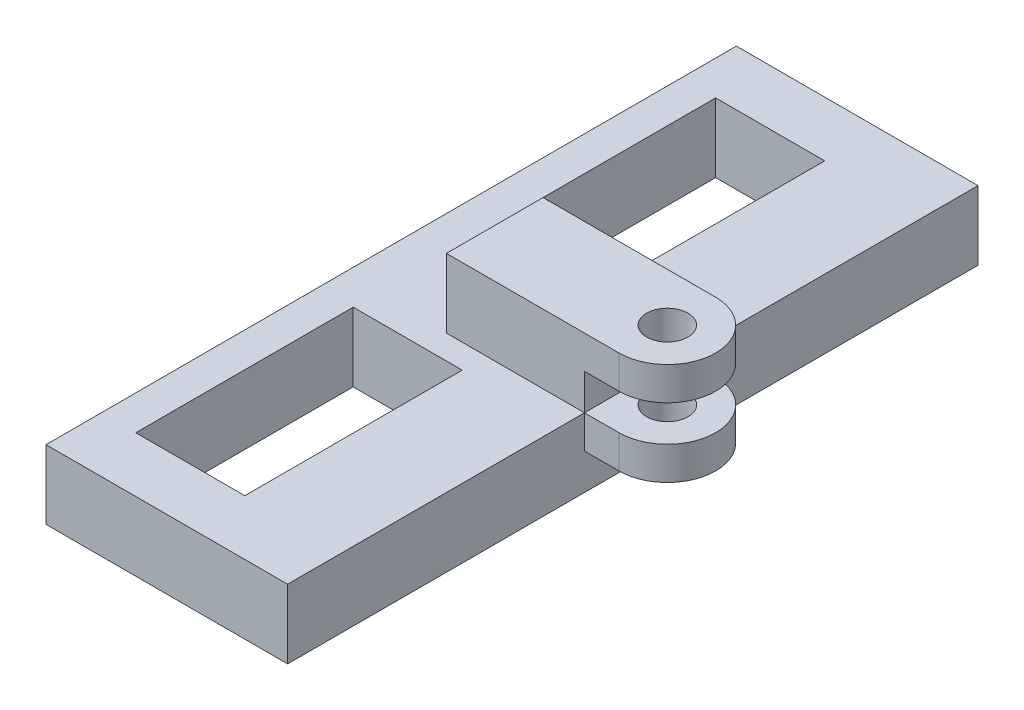
ISO-10303-21;
HEADER;
FILE_DESCRIPTION(('STEP AP214'),'2;1');
FILE_NAME('part.step','',(''),(''),'','','');
FILE_SCHEMA(('AUTOMOTIVE_DESIGN { 1 0 10303 214 1 1 1 1 }'));
ENDSEC;
DATA;
#1=APPLICATION_CONTEXT('core data for automotive mechanical design processes');
#2=APPLICATION_PROTOCOL_DEFINITION('international standard','automotive_design',2000,#1);
#3=PRODUCT_CONTEXT('',#1,'mechanical');
#4=PRODUCT('Part','Part','',(#3));
#5=PRODUCT_RELATED_PRODUCT_CATEGORY('part','',(#4));
#6=PRODUCT_DEFINITION_FORMATION('','',#4);
#7=PRODUCT_DEFINITION_CONTEXT('part definition',#1,'design');
#8=PRODUCT_DEFINITION('design','',#6,#7);
#9=PRODUCT_DEFINITION_SHAPE('','',#8);
#10=(LENGTH_UNIT() NAMED_UNIT(*) SI_UNIT(.MILLI.,.METRE.));
#11=(NAMED_UNIT(*) PLANE_ANGLE_UNIT() SI_UNIT($,.RADIAN.));
#12=(NAMED_UNIT(*) SI_UNIT($,.STERADIAN.) SOLID_ANGLE_UNIT());
#13=UNCERTAINTY_MEASURE_WITH_UNIT(LENGTH_MEASURE(1.E-05),#10,'distance_accuracy_value','');
#14=(GEOMETRIC_REPRESENTATION_CONTEXT(3) GLOBAL_UNCERTAINTY_ASSIGNED_CONTEXT((#13)) GLOBAL_UNIT_ASSIGNED_CONTEXT((#10,
#11,#12)) REPRESENTATION_CONTEXT('',''));
#15=CARTESIAN_POINT('',(0.,0.,0.));
#16=DIRECTION('',(0.,0.,1.));
#17=DIRECTION('',(1.,0.,0.));
#18=AXIS2_PLACEMENT_3D('',#15,#16,#17);
#19=CARTESIAN_POINT('',(28.575,0.,0.));
#20=DIRECTION('',(0.,1.,0.));
#21=DIRECTION('',(0.,0.,1.));
#22=AXIS2_PLACEMENT_3D('',#19,#20,#21);
#23=CYLINDRICAL_SURFACE('',#22,8.89);
#24=CARTESIAN_POINT('',(28.575,19.304,0.));
#25=DIRECTION('',(0.,1.,0.));
#26=DIRECTION('',(0.,0.,1.));
#27=AXIS2_PLACEMENT_3D('',#24,#25,#26);
#28=CIRCLE('',#27,8.89);
#29=CARTESIAN_POINT('',(28.575,19.304,-8.88999999999999));
#30=VERTEX_POINT('',#29);
#31=CARTESIAN_POINT('',(28.575,19.304,8.89000000000001));
#32=VERTEX_POINT('',#31);
#33=EDGE_CURVE('E334',#30,#32,#28,.F.);
#34=ORIENTED_EDGE('',*,*,#33,.F.);
#35=DIRECTION('',(0.,1.,0.));
#36=VECTOR('',#35,1.);
#37=CARTESIAN_POINT('',(28.575,0.,-8.88999999999999));
#38=LINE('',#37,#36);
#39=CARTESIAN_POINT('',(28.575,25.4,-8.88999999999999));
#40=VERTEX_POINT('',#39);
#41=EDGE_CURVE('E356',#30,#40,#38,.T.);
#42=ORIENTED_EDGE('',*,*,#41,.T.);
#43=CARTESIAN_POINT('',(28.575,25.4,0.));
#44=DIRECTION('',(0.,1.,0.));
#45=DIRECTION('',(0.,0.,1.));
#46=AXIS2_PLACEMENT_3D('',#43,#44,#45);
#47=CIRCLE('',#46,8.89);
#48=CARTESIAN_POINT('',(28.575,25.4,8.89000000000001));
#49=VERTEX_POINT('',#48);
#50=EDGE_CURVE('E344',#49,#40,#47,.T.);
#51=ORIENTED_EDGE('',*,*,#50,.F.);
#52=DIRECTION('',(0.,1.,0.));
#53=VECTOR('',#52,1.);
#54=CARTESIAN_POINT('',(28.575,0.,8.89000000000001));
#55=LINE('',#54,#53);
#56=EDGE_CURVE('E357',#32,#49,#55,.T.);
#57=ORIENTED_EDGE('',*,*,#56,.F.);
#58=EDGE_LOOP('',(#34,#42,#51,#57));
#59=FACE_BOUND('',#58,.T.);
#60=ADVANCED_FACE('F33',(#59),#23,.T.);
#61=CARTESIAN_POINT('',(-3.17499999999999,0.,8.89000000000001));
#62=DIRECTION('',(0.,0.,1.));
#63=DIRECTION('',(1.,0.,0.));
#64=AXIS2_PLACEMENT_3D('',#61,#62,#63);
#65=PLANE('',#64);
#66=DIRECTION('',(-1.,0.,0.));
#67=VECTOR('',#66,1.);
#68=CARTESIAN_POINT('',(22.225,19.304,8.89000000000001));
#69=LINE('',#68,#67);
#70=CARTESIAN_POINT('',(22.225,19.304,8.89000000000001));
#71=VERTEX_POINT('',#70);
#72=EDGE_CURVE('E184',#32,#71,#69,.T.);
#73=ORIENTED_EDGE('',*,*,#72,.F.);
#74=ORIENTED_EDGE('',*,*,#56,.T.);
#75=DIRECTION('',(1.,0.,0.));
#76=VECTOR('',#75,1.);
#77=CARTESIAN_POINT('',(-3.17499999999999,25.4,8.89000000000001));
#78=LINE('',#77,#76);
#79=CARTESIAN_POINT('',(-3.17499999999999,25.4,8.89000000000001));
#80=VERTEX_POINT('',#79);
#81=EDGE_CURVE('E353',#80,#49,#78,.T.);
#82=ORIENTED_EDGE('',*,*,#81,.F.);
#83=DIRECTION('',(0.,1.,0.));
#84=VECTOR('',#83,1.);
#85=CARTESIAN_POINT('',(-3.17499999999999,0.,8.89000000000001));
#86=LINE('',#85,#84);
#87=CARTESIAN_POINT('',(-3.17499999999999,12.7,8.89000000000001));
#88=VERTEX_POINT('',#87);
#89=EDGE_CURVE('E226',#88,#80,#86,.T.);
#90=ORIENTED_EDGE('',*,*,#89,.F.);
#91=DIRECTION('',(1.,0.,0.));
#92=VECTOR('',#91,1.);
#93=CARTESIAN_POINT('',(0.,12.7,8.89000000000001));
#94=LINE('',#93,#92);
#95=CARTESIAN_POINT('',(22.225,12.7,8.89000000000001));
#96=VERTEX_POINT('',#95);
#97=EDGE_CURVE('E215',#88,#96,#94,.T.);
#98=ORIENTED_EDGE('',*,*,#97,.T.);
#99=DIRECTION('',(0.,-1.,0.));
#100=VECTOR('',#99,1.);
#101=CARTESIAN_POINT('',(22.225,19.304,8.89000000000001));
#102=LINE('',#101,#100);
#103=EDGE_CURVE('E187',#71,#96,#102,.T.);
#104=ORIENTED_EDGE('',*,*,#103,.F.);
#105=EDGE_LOOP('',(#73,#74,#82,#90,#98,#104));
#106=FACE_BOUND('',#105,.T.);
#107=ADVANCED_FACE('F224',(#106),#65,.T.);
#108=CARTESIAN_POINT('',(28.575,0.,-8.88999999999999));
#109=DIRECTION('',(0.,0.,-1.));
#110=DIRECTION('',(-1.,0.,0.));
#111=AXIS2_PLACEMENT_3D('',#108,#109,#110);
#112=PLANE('',#111);
#113=DIRECTION('',(1.,0.,0.));
#114=VECTOR('',#113,1.);
#115=CARTESIAN_POINT('',(28.575,19.304,-8.88999999999999));
#116=LINE('',#115,#114);
#117=CARTESIAN_POINT('',(22.225,19.304,-8.88999999999999));
#118=VERTEX_POINT('',#117);
#119=EDGE_CURVE('E330',#118,#30,#116,.T.);
#120=ORIENTED_EDGE('',*,*,#119,.F.);
#121=DIRECTION('',(0.,1.,0.));
#122=VECTOR('',#121,1.);
#123=CARTESIAN_POINT('',(22.225,0.,-8.88999999999999));
#124=LINE('',#123,#122);
#125=CARTESIAN_POINT('',(22.225,12.7,-8.88999999999999));
#126=VERTEX_POINT('',#125);
#127=EDGE_CURVE('E11',#126,#118,#124,.T.);
#128=ORIENTED_EDGE('',*,*,#127,.F.);
#129=DIRECTION('',(-1.,0.,0.));
#130=VECTOR('',#129,1.);
#131=CARTESIAN_POINT('',(0.,12.7,-8.88999999999999));
#132=LINE('',#131,#130);
#133=CARTESIAN_POINT('',(-3.175,12.7,-8.88999999999999));
#134=VERTEX_POINT('',#133);
#135=EDGE_CURVE('E228',#126,#134,#132,.T.);
#136=ORIENTED_EDGE('',*,*,#135,.T.);
#137=DIRECTION('',(0.,1.,0.));
#138=VECTOR('',#137,1.);
#139=CARTESIAN_POINT('',(-3.175,0.,-8.88999999999999));
#140=LINE('',#139,#138);
#141=CARTESIAN_POINT('',(-3.175,25.4,-8.88999999999999));
#142=VERTEX_POINT('',#141);
#143=EDGE_CURVE('E360',#134,#142,#140,.T.);
#144=ORIENTED_EDGE('',*,*,#143,.T.);
#145=DIRECTION('',(-1.,0.,0.));
#146=VECTOR('',#145,1.);
#147=CARTESIAN_POINT('',(28.575,25.4,-8.88999999999999));
#148=LINE('',#147,#146);
#149=EDGE_CURVE('E347',#40,#142,#148,.T.);
#150=ORIENTED_EDGE('',*,*,#149,.F.);
#151=ORIENTED_EDGE('',*,*,#41,.F.);
#152=EDGE_LOOP('',(#120,#128,#136,#144,#150,#151));
#153=FACE_BOUND('',#152,.T.);
#154=ADVANCED_FACE('F427',(#153),#112,.T.);
#155=CARTESIAN_POINT('',(28.575,0.,0.));
#156=DIRECTION('',(0.,1.,0.));
#157=DIRECTION('',(0.,0.,1.));
#158=AXIS2_PLACEMENT_3D('',#155,#156,#157);
#159=CYLINDRICAL_SURFACE('',#158,3.81);
#160=CARTESIAN_POINT('',(28.575,19.304,0.));
#161=DIRECTION('',(0.,1.,0.));
#162=DIRECTION('',(0.,0.,1.));
#163=AXIS2_PLACEMENT_3D('',#160,#161,#162);
#164=CIRCLE('',#163,3.81);
#165=CARTESIAN_POINT('',(28.575,19.304,3.81000000000001));
#166=VERTEX_POINT('',#165);
#167=EDGE_CURVE('E328',#166,#166,#164,.F.);
#168=ORIENTED_EDGE('',*,*,#167,.T.);
#169=EDGE_LOOP('',(#168));
#170=FACE_BOUND('',#169,.T.);
#171=CARTESIAN_POINT('',(28.575,25.4,0.));
#172=DIRECTION('',(0.,1.,0.));
#173=DIRECTION('',(0.,0.,1.));
#174=AXIS2_PLACEMENT_3D('',#171,#172,#173);
#175=CIRCLE('',#174,3.81);
#176=CARTESIAN_POINT('',(28.575,25.4,3.81000000000001));
#177=VERTEX_POINT('',#176);
#178=EDGE_CURVE('E341',#177,#177,#175,.T.);
#179=ORIENTED_EDGE('',*,*,#178,.T.);
#180=EDGE_LOOP('',(#179));
#181=FACE_BOUND('',#180,.T.);
#182=ADVANCED_FACE('F451',(#170,#181),#159,.F.);
#183=CARTESIAN_POINT('',(0.,12.7,0.));
#184=DIRECTION('',(0.,1.,0.));
#185=DIRECTION('',(0.,0.,1.));
#186=AXIS2_PLACEMENT_3D('',#183,#184,#185);
#187=PLANE('',#186);
#188=ORIENTED_EDGE('',*,*,#97,.F.);
#189=DIRECTION('',(0.,0.,1.));
#190=VECTOR('',#189,1.);
#191=CARTESIAN_POINT('',(-3.175,12.7,0.));
#192=LINE('',#191,#190);
#193=EDGE_CURVE('E227',#134,#88,#192,.T.);
#194=ORIENTED_EDGE('',*,*,#193,.F.);
#195=ORIENTED_EDGE('',*,*,#135,.F.);
#196=DIRECTION('',(0.,0.,-1.));
#197=VECTOR('',#196,1.);
#198=CARTESIAN_POINT('',(22.225,12.7,-63.5));
#199=LINE('',#198,#197);
#200=CARTESIAN_POINT('',(22.225,12.7,-63.5));
#201=VERTEX_POINT('',#200);
#202=EDGE_CURVE('E221',#126,#201,#199,.T.);
#203=ORIENTED_EDGE('',*,*,#202,.T.);
#204=DIRECTION('',(-1.,0.,0.));
#205=VECTOR('',#204,1.);
#206=CARTESIAN_POINT('',(-22.225,12.7,-63.5));
#207=LINE('',#206,#205);
#208=CARTESIAN_POINT('',(-22.225,12.7,-63.5));
#209=VERTEX_POINT('',#208);
#210=EDGE_CURVE('E220',#201,#209,#207,.T.);
#211=ORIENTED_EDGE('',*,*,#210,.T.);
#212=DIRECTION('',(0.,0.,1.));
#213=VECTOR('',#212,1.);
#214=CARTESIAN_POINT('',(-22.225,12.7,-63.5));
#215=LINE('',#214,#213);
#216=CARTESIAN_POINT('',(-22.225,12.7,63.5));
#217=VERTEX_POINT('',#216);
#218=EDGE_CURVE('E299',#209,#217,#215,.T.);
#219=ORIENTED_EDGE('',*,*,#218,.T.);
#220=DIRECTION('',(1.,0.,0.));
#221=VECTOR('',#220,1.);
#222=CARTESIAN_POINT('',(-22.225,12.7,63.5));
#223=LINE('',#222,#221);
#224=CARTESIAN_POINT('',(22.225,12.7,63.5));
#225=VERTEX_POINT('',#224);
#226=EDGE_CURVE('E218',#217,#225,#223,.T.);
#227=ORIENTED_EDGE('',*,*,#226,.T.);
#228=EDGE_CURVE('E209',#225,#96,#199,.T.);
#229=ORIENTED_EDGE('',*,*,#228,.T.);
#230=EDGE_LOOP('',(#188,#194,#195,#203,#211,#219,#227,#229));
#231=FACE_BOUND('',#230,.T.);
#232=DIRECTION('',(1.,0.,0.));
#233=VECTOR('',#232,1.);
#234=CARTESIAN_POINT('',(-15.875,12.7,-13.33999999));
#235=LINE('',#234,#233);
#236=CARTESIAN_POINT('',(-15.875,12.7,-13.33999999));
#237=VERTEX_POINT('',#236);
#238=CARTESIAN_POINT('',(4.185000012,12.7,-13.33999999));
#239=VERTEX_POINT('',#238);
#240=EDGE_CURVE('E269',#237,#239,#235,.T.);
#241=ORIENTED_EDGE('',*,*,#240,.F.);
#242=DIRECTION('',(0.,0.,1.));
#243=VECTOR('',#242,1.);
#244=CARTESIAN_POINT('',(-15.875,12.7,-53.34));
#245=LINE('',#244,#243);
#246=CARTESIAN_POINT('',(-15.875,12.7,-53.34));
#247=VERTEX_POINT('',#246);
#248=EDGE_CURVE('E267',#247,#237,#245,.T.);
#249=ORIENTED_EDGE('',*,*,#248,.F.);
#250=DIRECTION('',(-1.,0.,0.));
#251=VECTOR('',#250,1.);
#252=CARTESIAN_POINT('',(-15.875,12.7,-53.34));
#253=LINE('',#252,#251);
#254=CARTESIAN_POINT('',(4.18500001199999,12.7,-53.34));
#255=VERTEX_POINT('',#254);
#256=EDGE_CURVE('E275',#255,#247,#253,.T.);
#257=ORIENTED_EDGE('',*,*,#256,.F.);
#258=DIRECTION('',(0.,0.,-1.));
#259=VECTOR('',#258,1.);
#260=CARTESIAN_POINT('',(4.18500001199999,12.7,-53.34));
#261=LINE('',#260,#259);
#262=EDGE_CURVE('E272',#239,#255,#261,.T.);
#263=ORIENTED_EDGE('',*,*,#262,.F.);
#264=EDGE_LOOP('',(#241,#249,#257,#263));
#265=FACE_BOUND('',#264,.T.);
#266=DIRECTION('',(1.,0.,0.));
#267=VECTOR('',#266,1.);
#268=CARTESIAN_POINT('',(-15.875,12.7,53.34));
#269=LINE('',#268,#267);
#270=CARTESIAN_POINT('',(-15.875,12.7,53.34));
#271=VERTEX_POINT('',#270);
#272=CARTESIAN_POINT('',(4.18500001200001,12.7,53.34));
#273=VERTEX_POINT('',#272);
#274=EDGE_CURVE('E238',#271,#273,#269,.T.);
#275=ORIENTED_EDGE('',*,*,#274,.F.);
#276=DIRECTION('',(0.,0.,1.));
#277=VECTOR('',#276,1.);
#278=CARTESIAN_POINT('',(-15.875,12.7,13.33999999));
#279=LINE('',#278,#277);
#280=CARTESIAN_POINT('',(-15.875,12.7,13.33999999));
#281=VERTEX_POINT('',#280);
#282=EDGE_CURVE('E236',#281,#271,#279,.T.);
#283=ORIENTED_EDGE('',*,*,#282,.F.);
#284=DIRECTION('',(-1.,0.,0.));
#285=VECTOR('',#284,1.);
#286=CARTESIAN_POINT('',(-15.875,12.7,13.33999999));
#287=LINE('',#286,#285);
#288=CARTESIAN_POINT('',(4.185000012,12.7,13.33999999));
#289=VERTEX_POINT('',#288);
#290=EDGE_CURVE('E244',#289,#281,#287,.T.);
#291=ORIENTED_EDGE('',*,*,#290,.F.);
#292=DIRECTION('',(0.,0.,-1.));
#293=VECTOR('',#292,1.);
#294=CARTESIAN_POINT('',(4.185000012,12.7,13.33999999));
#295=LINE('',#294,#293);
#296=EDGE_CURVE('E241',#273,#289,#295,.T.);
#297=ORIENTED_EDGE('',*,*,#296,.F.);
#298=EDGE_LOOP('',(#275,#283,#291,#297));
#299=FACE_BOUND('',#298,.T.);
#300=ADVANCED_FACE('F213',(#231,#265,#299),#187,.T.);
#301=CARTESIAN_POINT('',(0.,0.,0.));
#302=DIRECTION('',(0.,1.,0.));
#303=DIRECTION('',(0.,0.,1.));
#304=AXIS2_PLACEMENT_3D('',#301,#302,#303);
#305=PLANE('',#304);
#306=DIRECTION('',(-1.,0.,0.));
#307=VECTOR('',#306,1.);
#308=CARTESIAN_POINT('',(-22.225,0.,-63.5));
#309=LINE('',#308,#307);
#310=CARTESIAN_POINT('',(22.225,0.,-63.5));
#311=VERTEX_POINT('',#310);
#312=CARTESIAN_POINT('',(-22.225,0.,-63.5));
#313=VERTEX_POINT('',#312);
#314=EDGE_CURVE('E304',#311,#313,#309,.T.);
#315=ORIENTED_EDGE('',*,*,#314,.F.);
#316=DIRECTION('',(0.,0.,-1.));
#317=VECTOR('',#316,1.);
#318=CARTESIAN_POINT('',(22.225,0.,-63.5));
#319=LINE('',#318,#317);
#320=CARTESIAN_POINT('',(22.225,0.,63.5));
#321=VERTEX_POINT('',#320);
#322=EDGE_CURVE('E296',#321,#311,#319,.T.);
#323=ORIENTED_EDGE('',*,*,#322,.F.);
#324=DIRECTION('',(1.,0.,0.));
#325=VECTOR('',#324,1.);
#326=CARTESIAN_POINT('',(-22.225,0.,63.5));
#327=LINE('',#326,#325);
#328=CARTESIAN_POINT('',(-22.225,0.,63.5));
#329=VERTEX_POINT('',#328);
#330=EDGE_CURVE('E308',#329,#321,#327,.T.);
#331=ORIENTED_EDGE('',*,*,#330,.F.);
#332=DIRECTION('',(0.,0.,1.));
#333=VECTOR('',#332,1.);
#334=CARTESIAN_POINT('',(-22.225,0.,-63.5));
#335=LINE('',#334,#333);
#336=EDGE_CURVE('E306',#313,#329,#335,.T.);
#337=ORIENTED_EDGE('',*,*,#336,.F.);
#338=EDGE_LOOP('',(#315,#323,#331,#337));
#339=FACE_BOUND('',#338,.T.);
#340=DIRECTION('',(0.,0.,1.));
#341=VECTOR('',#340,1.);
#342=CARTESIAN_POINT('',(-15.875,0.,-53.34));
#343=LINE('',#342,#341);
#344=CARTESIAN_POINT('',(-15.875,0.,-53.34));
#345=VERTEX_POINT('',#344);
#346=CARTESIAN_POINT('',(-15.875,0.,-13.33999999));
#347=VERTEX_POINT('',#346);
#348=EDGE_CURVE('E266',#345,#347,#343,.T.);
#349=ORIENTED_EDGE('',*,*,#348,.T.);
#350=DIRECTION('',(1.,0.,0.));
#351=VECTOR('',#350,1.);
#352=CARTESIAN_POINT('',(-15.875,0.,-13.33999999));
#353=LINE('',#352,#351);
#354=CARTESIAN_POINT('',(4.185000012,0.,-13.33999999));
#355=VERTEX_POINT('',#354);
#356=EDGE_CURVE('E280',#347,#355,#353,.T.);
#357=ORIENTED_EDGE('',*,*,#356,.T.);
#358=DIRECTION('',(0.,0.,-1.));
#359=VECTOR('',#358,1.);
#360=CARTESIAN_POINT('',(4.18500001199999,0.,-53.34));
#361=LINE('',#360,#359);
#362=CARTESIAN_POINT('',(4.18500001199999,0.,-53.34));
#363=VERTEX_POINT('',#362);
#364=EDGE_CURVE('E283',#355,#363,#361,.T.);
#365=ORIENTED_EDGE('',*,*,#364,.T.);
#366=DIRECTION('',(-1.,0.,0.));
#367=VECTOR('',#366,1.);
#368=CARTESIAN_POINT('',(-15.875,0.,-53.34));
#369=LINE('',#368,#367);
#370=EDGE_CURVE('E270',#363,#345,#369,.T.);
#371=ORIENTED_EDGE('',*,*,#370,.T.);
#372=EDGE_LOOP('',(#349,#357,#365,#371));
#373=FACE_BOUND('',#372,.T.);
#374=DIRECTION('',(0.,0.,1.));
#375=VECTOR('',#374,1.);
#376=CARTESIAN_POINT('',(-15.875,0.,13.33999999));
#377=LINE('',#376,#375);
#378=CARTESIAN_POINT('',(-15.875,0.,13.33999999));
#379=VERTEX_POINT('',#378);
#380=CARTESIAN_POINT('',(-15.875,0.,53.34));
#381=VERTEX_POINT('',#380);
#382=EDGE_CURVE('E230',#379,#381,#377,.T.);
#383=ORIENTED_EDGE('',*,*,#382,.T.);
#384=DIRECTION('',(1.,0.,0.));
#385=VECTOR('',#384,1.);
#386=CARTESIAN_POINT('',(-15.875,0.,53.34));
#387=LINE('',#386,#385);
#388=CARTESIAN_POINT('',(4.18500001200001,0.,53.34));
#389=VERTEX_POINT('',#388);
#390=EDGE_CURVE('E249',#381,#389,#387,.T.);
#391=ORIENTED_EDGE('',*,*,#390,.T.);
#392=DIRECTION('',(0.,0.,-1.));
#393=VECTOR('',#392,1.);
#394=CARTESIAN_POINT('',(4.185000012,0.,13.33999999));
#395=LINE('',#394,#393);
#396=CARTESIAN_POINT('',(4.185000012,0.,13.33999999));
#397=VERTEX_POINT('',#396);
#398=EDGE_CURVE('E252',#389,#397,#395,.T.);
#399=ORIENTED_EDGE('',*,*,#398,.T.);
#400=DIRECTION('',(-1.,0.,0.));
#401=VECTOR('',#400,1.);
#402=CARTESIAN_POINT('',(-15.875,0.,13.33999999));
#403=LINE('',#402,#401);
#404=EDGE_CURVE('E239',#397,#379,#403,.T.);
#405=ORIENTED_EDGE('',*,*,#404,.T.);
#406=EDGE_LOOP('',(#383,#391,#399,#405));
#407=FACE_BOUND('',#406,.T.);
#408=ADVANCED_FACE('F391',(#339,#373,#407),#305,.F.);
#409=CARTESIAN_POINT('',(22.225,12.7,-63.5));
#410=DIRECTION('',(-1.,0.,0.));
#411=DIRECTION('',(0.,0.,1.));
#412=AXIS2_PLACEMENT_3D('',#409,#410,#411);
#413=PLANE('',#412);
#414=DIRECTION('',(0.,-1.,0.));
#415=VECTOR('',#414,1.);
#416=CARTESIAN_POINT('',(22.225,12.7,-8.89));
#417=LINE('',#416,#415);
#418=CARTESIAN_POINT('',(22.225,6.604,-8.89));
#419=VERTEX_POINT('',#418);
#420=EDGE_CURVE('E210',#126,#419,#417,.T.);
#421=ORIENTED_EDGE('',*,*,#420,.T.);
#422=DIRECTION('',(0.,0.,1.));
#423=VECTOR('',#422,1.);
#424=CARTESIAN_POINT('',(22.225,6.604,-14.224));
#425=LINE('',#424,#423);
#426=CARTESIAN_POINT('',(22.225,6.604,8.89000000000001));
#427=VERTEX_POINT('',#426);
#428=EDGE_CURVE('E56',#419,#427,#425,.T.);
#429=ORIENTED_EDGE('',*,*,#428,.T.);
#430=DIRECTION('',(0.,1.,0.));
#431=VECTOR('',#430,1.);
#432=CARTESIAN_POINT('',(22.225,12.7,8.89000000000001));
#433=LINE('',#432,#431);
#434=EDGE_CURVE('E41',#427,#96,#433,.T.);
#435=ORIENTED_EDGE('',*,*,#434,.T.);
#436=ORIENTED_EDGE('',*,*,#228,.F.);
#437=DIRECTION('',(0.,-1.,0.));
#438=VECTOR('',#437,1.);
#439=CARTESIAN_POINT('',(22.225,12.7,63.5));
#440=LINE('',#439,#438);
#441=EDGE_CURVE('E302',#225,#321,#440,.T.);
#442=ORIENTED_EDGE('',*,*,#441,.T.);
#443=ORIENTED_EDGE('',*,*,#322,.T.);
#444=DIRECTION('',(0.,-1.,0.));
#445=VECTOR('',#444,1.);
#446=CARTESIAN_POINT('',(22.225,12.7,-63.5));
#447=LINE('',#446,#445);
#448=EDGE_CURVE('E317',#201,#311,#447,.T.);
#449=ORIENTED_EDGE('',*,*,#448,.F.);
#450=ORIENTED_EDGE('',*,*,#202,.F.);
#451=EDGE_LOOP('',(#421,#429,#435,#436,#442,#443,#449,#450));
#452=FACE_BOUND('',#451,.T.);
#453=ADVANCED_FACE('F35',(#452),#413,.F.);
#454=CARTESIAN_POINT('',(-22.225,12.7,-63.5));
#455=DIRECTION('',(0.,0.,1.));
#456=DIRECTION('',(1.,0.,0.));
#457=AXIS2_PLACEMENT_3D('',#454,#455,#456);
#458=PLANE('',#457);
#459=ORIENTED_EDGE('',*,*,#314,.T.);
#460=DIRECTION('',(0.,-1.,0.));
#461=VECTOR('',#460,1.);
#462=CARTESIAN_POINT('',(-22.225,12.7,-63.5));
#463=LINE('',#462,#461);
#464=EDGE_CURVE('E314',#209,#313,#463,.T.);
#465=ORIENTED_EDGE('',*,*,#464,.F.);
#466=ORIENTED_EDGE('',*,*,#210,.F.);
#467=ORIENTED_EDGE('',*,*,#448,.T.);
#468=EDGE_LOOP('',(#459,#465,#466,#467));
#469=FACE_BOUND('',#468,.T.);
#470=ADVANCED_FACE('F379',(#469),#458,.F.);
#471=CARTESIAN_POINT('',(-22.225,12.7,-63.5));
#472=DIRECTION('',(1.,0.,0.));
#473=DIRECTION('',(0.,0.,-1.));
#474=AXIS2_PLACEMENT_3D('',#471,#472,#473);
#475=PLANE('',#474);
#476=ORIENTED_EDGE('',*,*,#336,.T.);
#477=DIRECTION('',(0.,-1.,0.));
#478=VECTOR('',#477,1.);
#479=CARTESIAN_POINT('',(-22.225,12.7,63.5));
#480=LINE('',#479,#478);
#481=EDGE_CURVE('E311',#217,#329,#480,.T.);
#482=ORIENTED_EDGE('',*,*,#481,.F.);
#483=ORIENTED_EDGE('',*,*,#218,.F.);
#484=ORIENTED_EDGE('',*,*,#464,.T.);
#485=EDGE_LOOP('',(#476,#482,#483,#484));
#486=FACE_BOUND('',#485,.T.);
#487=ADVANCED_FACE('F385',(#486),#475,.F.);
#488=CARTESIAN_POINT('',(-22.225,12.7,63.5));
#489=DIRECTION('',(0.,0.,-1.));
#490=DIRECTION('',(-1.,0.,0.));
#491=AXIS2_PLACEMENT_3D('',#488,#489,#490);
#492=PLANE('',#491);
#493=ORIENTED_EDGE('',*,*,#330,.T.);
#494=ORIENTED_EDGE('',*,*,#441,.F.);
#495=ORIENTED_EDGE('',*,*,#226,.F.);
#496=ORIENTED_EDGE('',*,*,#481,.T.);
#497=EDGE_LOOP('',(#493,#494,#495,#496));
#498=FACE_BOUND('',#497,.T.);
#499=ADVANCED_FACE('F388',(#498),#492,.F.);
#500=CARTESIAN_POINT('',(-15.875,12.7,-53.34));
#501=DIRECTION('',(1.,0.,0.));
#502=DIRECTION('',(0.,0.,-1.));
#503=AXIS2_PLACEMENT_3D('',#500,#501,#502);
#504=PLANE('',#503);
#505=ORIENTED_EDGE('',*,*,#348,.F.);
#506=DIRECTION('',(0.,-1.,0.));
#507=VECTOR('',#506,1.);
#508=CARTESIAN_POINT('',(-15.875,12.7,-53.34));
#509=LINE('',#508,#507);
#510=EDGE_CURVE('E277',#247,#345,#509,.T.);
#511=ORIENTED_EDGE('',*,*,#510,.F.);
#512=ORIENTED_EDGE('',*,*,#248,.T.);
#513=DIRECTION('',(0.,-1.,0.));
#514=VECTOR('',#513,1.);
#515=CARTESIAN_POINT('',(-15.875,12.7,-13.33999999));
#516=LINE('',#515,#514);
#517=EDGE_CURVE('E294',#237,#347,#516,.T.);
#518=ORIENTED_EDGE('',*,*,#517,.T.);
#519=EDGE_LOOP('',(#505,#511,#512,#518));
#520=FACE_BOUND('',#519,.T.);
#521=ADVANCED_FACE('F593',(#520),#504,.T.);
#522=CARTESIAN_POINT('',(-15.875,12.7,-13.33999999));
#523=DIRECTION('',(0.,0.,-1.));
#524=DIRECTION('',(-1.,0.,0.));
#525=AXIS2_PLACEMENT_3D('',#522,#523,#524);
#526=PLANE('',#525);
#527=ORIENTED_EDGE('',*,*,#356,.F.);
#528=ORIENTED_EDGE('',*,*,#517,.F.);
#529=ORIENTED_EDGE('',*,*,#240,.T.);
#530=DIRECTION('',(0.,-1.,0.));
#531=VECTOR('',#530,1.);
#532=CARTESIAN_POINT('',(4.185000012,12.7,-13.33999999));
#533=LINE('',#532,#531);
#534=EDGE_CURVE('E292',#239,#355,#533,.T.);
#535=ORIENTED_EDGE('',*,*,#534,.T.);
#536=EDGE_LOOP('',(#527,#528,#529,#535));
#537=FACE_BOUND('',#536,.T.);
#538=ADVANCED_FACE('F600',(#537),#526,.T.);
#539=CARTESIAN_POINT('',(4.18500001199999,12.7,-53.34));
#540=DIRECTION('',(-1.,0.,0.));
#541=DIRECTION('',(0.,0.,1.));
#542=AXIS2_PLACEMENT_3D('',#539,#540,#541);
#543=PLANE('',#542);
#544=ORIENTED_EDGE('',*,*,#364,.F.);
#545=ORIENTED_EDGE('',*,*,#534,.F.);
#546=ORIENTED_EDGE('',*,*,#262,.T.);
#547=DIRECTION('',(0.,-1.,0.));
#548=VECTOR('',#547,1.);
#549=CARTESIAN_POINT('',(4.18500001199999,12.7,-53.34));
#550=LINE('',#549,#548);
#551=EDGE_CURVE('E290',#255,#363,#550,.T.);
#552=ORIENTED_EDGE('',*,*,#551,.T.);
#553=EDGE_LOOP('',(#544,#545,#546,#552));
#554=FACE_BOUND('',#553,.T.);
#555=ADVANCED_FACE('F608',(#554),#543,.T.);
#556=CARTESIAN_POINT('',(-15.875,12.7,-53.34));
#557=DIRECTION('',(0.,0.,1.));
#558=DIRECTION('',(1.,0.,0.));
#559=AXIS2_PLACEMENT_3D('',#556,#557,#558);
#560=PLANE('',#559);
#561=ORIENTED_EDGE('',*,*,#370,.F.);
#562=ORIENTED_EDGE('',*,*,#551,.F.);
#563=ORIENTED_EDGE('',*,*,#256,.T.);
#564=ORIENTED_EDGE('',*,*,#510,.T.);
#565=EDGE_LOOP('',(#561,#562,#563,#564));
#566=FACE_BOUND('',#565,.T.);
#567=ADVANCED_FACE('F616',(#566),#560,.T.);
#568=CARTESIAN_POINT('',(-15.875,12.7,13.33999999));
#569=DIRECTION('',(1.,0.,0.));
#570=DIRECTION('',(0.,0.,-1.));
#571=AXIS2_PLACEMENT_3D('',#568,#569,#570);
#572=PLANE('',#571);
#573=ORIENTED_EDGE('',*,*,#382,.F.);
#574=DIRECTION('',(0.,-1.,0.));
#575=VECTOR('',#574,1.);
#576=CARTESIAN_POINT('',(-15.875,12.7,13.33999999));
#577=LINE('',#576,#575);
#578=EDGE_CURVE('E246',#281,#379,#577,.T.);
#579=ORIENTED_EDGE('',*,*,#578,.F.);
#580=ORIENTED_EDGE('',*,*,#282,.T.);
#581=DIRECTION('',(0.,-1.,0.));
#582=VECTOR('',#581,1.);
#583=CARTESIAN_POINT('',(-15.875,12.7,53.34));
#584=LINE('',#583,#582);
#585=EDGE_CURVE('E263',#271,#381,#584,.T.);
#586=ORIENTED_EDGE('',*,*,#585,.T.);
#587=EDGE_LOOP('',(#573,#579,#580,#586));
#588=FACE_BOUND('',#587,.T.);
#589=ADVANCED_FACE('F399',(#588),#572,.T.);
#590=CARTESIAN_POINT('',(-15.875,12.7,53.34));
#591=DIRECTION('',(0.,0.,-1.));
#592=DIRECTION('',(-1.,0.,0.));
#593=AXIS2_PLACEMENT_3D('',#590,#591,#592);
#594=PLANE('',#593);
#595=ORIENTED_EDGE('',*,*,#390,.F.);
#596=ORIENTED_EDGE('',*,*,#585,.F.);
#597=ORIENTED_EDGE('',*,*,#274,.T.);
#598=DIRECTION('',(0.,-1.,0.));
#599=VECTOR('',#598,1.);
#600=CARTESIAN_POINT('',(4.18500001200001,12.7,53.34));
#601=LINE('',#600,#599);
#602=EDGE_CURVE('E261',#273,#389,#601,.T.);
#603=ORIENTED_EDGE('',*,*,#602,.T.);
#604=EDGE_LOOP('',(#595,#596,#597,#603));
#605=FACE_BOUND('',#604,.T.);
#606=ADVANCED_FACE('F409',(#605),#594,.T.);
#607=CARTESIAN_POINT('',(4.185000012,12.7,13.33999999));
#608=DIRECTION('',(-1.,0.,0.));
#609=DIRECTION('',(0.,0.,1.));
#610=AXIS2_PLACEMENT_3D('',#607,#608,#609);
#611=PLANE('',#610);
#612=ORIENTED_EDGE('',*,*,#398,.F.);
#613=ORIENTED_EDGE('',*,*,#602,.F.);
#614=ORIENTED_EDGE('',*,*,#296,.T.);
#615=DIRECTION('',(0.,-1.,0.));
#616=VECTOR('',#615,1.);
#617=CARTESIAN_POINT('',(4.185000012,12.7,13.33999999));
#618=LINE('',#617,#616);
#619=EDGE_CURVE('E259',#289,#397,#618,.T.);
#620=ORIENTED_EDGE('',*,*,#619,.T.);
#621=EDGE_LOOP('',(#612,#613,#614,#620));
#622=FACE_BOUND('',#621,.T.);
#623=ADVANCED_FACE('F413',(#622),#611,.T.);
#624=CARTESIAN_POINT('',(-15.875,12.7,13.33999999));
#625=DIRECTION('',(0.,0.,1.));
#626=DIRECTION('',(1.,0.,0.));
#627=AXIS2_PLACEMENT_3D('',#624,#625,#626);
#628=PLANE('',#627);
#629=ORIENTED_EDGE('',*,*,#404,.F.);
#630=ORIENTED_EDGE('',*,*,#619,.F.);
#631=ORIENTED_EDGE('',*,*,#290,.T.);
#632=ORIENTED_EDGE('',*,*,#578,.T.);
#633=EDGE_LOOP('',(#629,#630,#631,#632));
#634=FACE_BOUND('',#633,.T.);
#635=ADVANCED_FACE('F403',(#634),#628,.T.);
#636=CARTESIAN_POINT('',(28.575,12.7,0.));
#637=DIRECTION('',(0.,-1.,0.));
#638=DIRECTION('',(0.,0.,-1.));
#639=AXIS2_PLACEMENT_3D('',#636,#637,#638);
#640=CIRCLE('',#639,8.89);
#641=CARTESIAN_POINT('',(28.575,12.7,8.89000000000001));
#642=VERTEX_POINT('',#641);
#643=CARTESIAN_POINT('',(28.575,12.7,-8.88999999999999));
#644=VERTEX_POINT('',#643);
#645=EDGE_CURVE('E48',#642,#644,#640,.F.);
#646=ORIENTED_EDGE('',*,*,#645,.F.);
#647=CARTESIAN_POINT('',(28.575,6.604,8.89000000000001));
#648=VERTEX_POINT('',#647);
#649=EDGE_CURVE('E202',#648,#642,#55,.T.);
#650=ORIENTED_EDGE('',*,*,#649,.F.);
#651=CARTESIAN_POINT('',(28.575,6.604,0.));
#652=DIRECTION('',(0.,1.,0.));
#653=DIRECTION('',(-1.,0.,0.));
#654=AXIS2_PLACEMENT_3D('',#651,#652,#653);
#655=CIRCLE('',#654,8.89);
#656=CARTESIAN_POINT('',(28.575,6.604,-8.88999999999999));
#657=VERTEX_POINT('',#656);
#658=EDGE_CURVE('E327',#657,#648,#655,.F.);
#659=ORIENTED_EDGE('',*,*,#658,.F.);
#660=EDGE_CURVE('E361',#657,#644,#38,.T.);
#661=ORIENTED_EDGE('',*,*,#660,.T.);
#662=EDGE_LOOP('',(#646,#650,#659,#661));
#663=FACE_BOUND('',#662,.T.);
#664=ADVANCED_FACE('F369',(#663),#23,.T.);
#665=DIRECTION('',(1.,0.,0.));
#666=VECTOR('',#665,1.);
#667=CARTESIAN_POINT('',(22.225,12.7,8.89000000000001));
#668=LINE('',#667,#666);
#669=EDGE_CURVE('E179',#96,#642,#668,.T.);
#670=ORIENTED_EDGE('',*,*,#669,.F.);
#671=ORIENTED_EDGE('',*,*,#434,.F.);
#672=DIRECTION('',(-1.,0.,0.));
#673=VECTOR('',#672,1.);
#674=CARTESIAN_POINT('',(37.465,6.604,8.89000000000001));
#675=LINE('',#674,#673);
#676=EDGE_CURVE('E463',#648,#427,#675,.T.);
#677=ORIENTED_EDGE('',*,*,#676,.F.);
#678=ORIENTED_EDGE('',*,*,#649,.T.);
#679=EDGE_LOOP('',(#670,#671,#677,#678));
#680=FACE_BOUND('',#679,.T.);
#681=ADVANCED_FACE('F199',(#680),#65,.T.);
#682=CARTESIAN_POINT('',(-3.175,0.,-8.88999999999999));
#683=DIRECTION('',(-1.,0.,0.));
#684=DIRECTION('',(0.,0.,1.));
#685=AXIS2_PLACEMENT_3D('',#682,#683,#684);
#686=PLANE('',#685);
#687=ORIENTED_EDGE('',*,*,#143,.F.);
#688=ORIENTED_EDGE('',*,*,#193,.T.);
#689=ORIENTED_EDGE('',*,*,#89,.T.);
#690=DIRECTION('',(0.,0.,1.));
#691=VECTOR('',#690,1.);
#692=CARTESIAN_POINT('',(-3.175,25.4,-8.88999999999999));
#693=LINE('',#692,#691);
#694=EDGE_CURVE('E350',#142,#80,#693,.T.);
#695=ORIENTED_EDGE('',*,*,#694,.F.);
#696=EDGE_LOOP('',(#687,#688,#689,#695));
#697=FACE_BOUND('',#696,.T.);
#698=ADVANCED_FACE('F434',(#697),#686,.T.);
#699=DIRECTION('',(-1.,0.,0.));
#700=VECTOR('',#699,1.);
#701=CARTESIAN_POINT('',(28.575,12.7,-8.88999999999999));
#702=LINE('',#701,#700);
#703=EDGE_CURVE('E180',#644,#126,#702,.T.);
#704=ORIENTED_EDGE('',*,*,#703,.F.);
#705=ORIENTED_EDGE('',*,*,#660,.F.);
#706=DIRECTION('',(1.,0.,0.));
#707=VECTOR('',#706,1.);
#708=CARTESIAN_POINT('',(28.575,6.604,-8.88999999999999));
#709=LINE('',#708,#707);
#710=EDGE_CURVE('E324',#419,#657,#709,.T.);
#711=ORIENTED_EDGE('',*,*,#710,.F.);
#712=ORIENTED_EDGE('',*,*,#420,.F.);
#713=EDGE_LOOP('',(#704,#705,#711,#712));
#714=FACE_BOUND('',#713,.T.);
#715=ADVANCED_FACE('F371',(#714),#112,.T.);
#716=CARTESIAN_POINT('',(28.575,25.4,0.));
#717=DIRECTION('',(0.,1.,0.));
#718=DIRECTION('',(0.,0.,1.));
#719=AXIS2_PLACEMENT_3D('',#716,#717,#718);
#720=PLANE('',#719);
#721=ORIENTED_EDGE('',*,*,#50,.T.);
#722=ORIENTED_EDGE('',*,*,#149,.T.);
#723=ORIENTED_EDGE('',*,*,#694,.T.);
#724=ORIENTED_EDGE('',*,*,#81,.T.);
#725=EDGE_LOOP('',(#721,#722,#723,#724));
#726=FACE_BOUND('',#725,.T.);
#727=ORIENTED_EDGE('',*,*,#178,.F.);
#728=EDGE_LOOP('',(#727));
#729=FACE_BOUND('',#728,.T.);
#730=ADVANCED_FACE('F444',(#726,#729),#720,.T.);
#731=CARTESIAN_POINT('',(37.465,6.604,-14.224));
#732=DIRECTION('',(0.,1.,0.));
#733=DIRECTION('',(-1.,0.,0.));
#734=AXIS2_PLACEMENT_3D('',#731,#732,#733);
#735=PLANE('',#734);
#736=ORIENTED_EDGE('',*,*,#658,.T.);
#737=ORIENTED_EDGE('',*,*,#676,.T.);
#738=ORIENTED_EDGE('',*,*,#428,.F.);
#739=ORIENTED_EDGE('',*,*,#710,.T.);
#740=EDGE_LOOP('',(#736,#737,#738,#739));
#741=FACE_BOUND('',#740,.T.);
#742=CARTESIAN_POINT('',(28.575,6.604,0.));
#743=DIRECTION('',(0.,1.,0.));
#744=DIRECTION('',(-1.,0.,0.));
#745=AXIS2_PLACEMENT_3D('',#742,#743,#744);
#746=CIRCLE('',#745,3.81);
#747=CARTESIAN_POINT('',(24.765,6.604,0.));
#748=VERTEX_POINT('',#747);
#749=EDGE_CURVE('E321',#748,#748,#746,.F.);
#750=ORIENTED_EDGE('',*,*,#749,.F.);
#751=EDGE_LOOP('',(#750));
#752=FACE_BOUND('',#751,.T.);
#753=ADVANCED_FACE('F448',(#741,#752),#735,.F.);
#754=CARTESIAN_POINT('',(22.225,19.304,-14.224));
#755=DIRECTION('',(0.,1.,0.));
#756=DIRECTION('',(0.,0.,1.));
#757=AXIS2_PLACEMENT_3D('',#754,#755,#756);
#758=PLANE('',#757);
#759=ORIENTED_EDGE('',*,*,#33,.T.);
#760=ORIENTED_EDGE('',*,*,#72,.T.);
#761=DIRECTION('',(0.,0.,1.));
#762=VECTOR('',#761,1.);
#763=CARTESIAN_POINT('',(22.225,19.304,-14.224));
#764=LINE('',#763,#762);
#765=EDGE_CURVE('E183',#118,#71,#764,.T.);
#766=ORIENTED_EDGE('',*,*,#765,.F.);
#767=ORIENTED_EDGE('',*,*,#119,.T.);
#768=EDGE_LOOP('',(#759,#760,#766,#767));
#769=FACE_BOUND('',#768,.T.);
#770=ORIENTED_EDGE('',*,*,#167,.F.);
#771=EDGE_LOOP('',(#770));
#772=FACE_BOUND('',#771,.T.);
#773=ADVANCED_FACE('F458',(#769,#772),#758,.F.);
#774=CARTESIAN_POINT('',(22.225,12.7,-14.224));
#775=DIRECTION('',(0.,-1.,0.));
#776=DIRECTION('',(0.,0.,-1.));
#777=AXIS2_PLACEMENT_3D('',#774,#775,#776);
#778=PLANE('',#777);
#779=ORIENTED_EDGE('',*,*,#645,.T.);
#780=ORIENTED_EDGE('',*,*,#703,.T.);
#781=DIRECTION('',(0.,0.,1.));
#782=VECTOR('',#781,1.);
#783=CARTESIAN_POINT('',(22.225,12.7,-14.224));
#784=LINE('',#783,#782);
#785=EDGE_CURVE('E174',#126,#96,#784,.T.);
#786=ORIENTED_EDGE('',*,*,#785,.T.);
#787=ORIENTED_EDGE('',*,*,#669,.T.);
#788=EDGE_LOOP('',(#779,#780,#786,#787));
#789=FACE_BOUND('',#788,.T.);
#790=CARTESIAN_POINT('',(28.575,12.7,0.));
#791=DIRECTION('',(0.,-1.,0.));
#792=DIRECTION('',(0.,0.,-1.));
#793=AXIS2_PLACEMENT_3D('',#790,#791,#792);
#794=CIRCLE('',#793,3.81);
#795=CARTESIAN_POINT('',(28.575,12.7,-3.80999999999999));
#796=VERTEX_POINT('',#795);
#797=EDGE_CURVE('E325',#796,#796,#794,.F.);
#798=ORIENTED_EDGE('',*,*,#797,.F.);
#799=EDGE_LOOP('',(#798));
#800=FACE_BOUND('',#799,.T.);
#801=ADVANCED_FACE('F176',(#789,#800),#778,.F.);
#802=CARTESIAN_POINT('',(22.225,19.304,-14.224));
#803=DIRECTION('',(-1.,0.,0.));
#804=DIRECTION('',(0.,0.,1.));
#805=AXIS2_PLACEMENT_3D('',#802,#803,#804);
#806=PLANE('',#805);
#807=ORIENTED_EDGE('',*,*,#127,.T.);
#808=ORIENTED_EDGE('',*,*,#765,.T.);
#809=ORIENTED_EDGE('',*,*,#103,.T.);
#810=ORIENTED_EDGE('',*,*,#785,.F.);
#811=EDGE_LOOP('',(#807,#808,#809,#810));
#812=FACE_BOUND('',#811,.T.);
#813=ADVANCED_FACE('F188',(#812),#806,.F.);
#814=ORIENTED_EDGE('',*,*,#797,.T.);
#815=EDGE_LOOP('',(#814));
#816=FACE_BOUND('',#815,.T.);
#817=ORIENTED_EDGE('',*,*,#749,.T.);
#818=EDGE_LOOP('',(#817));
#819=FACE_BOUND('',#818,.T.);
#820=ADVANCED_FACE('F441',(#816,#819),#159,.F.);
#821=CLOSED_SHELL('',(#60,#107,#154,#182,#300,#408,#453,#470,#487,#499,#521,#538,#555,#567,#589,
#606,#623,#635,#664,#681,#698,#715,#730,#753,#773,#801,#813,#820));
#822=MANIFOLD_SOLID_BREP('B2',#821);
#823=ADVANCED_BREP_SHAPE_REPRESENTATION('',(#18,#822),#14);
#824=SHAPE_DEFINITION_REPRESENTATION(#9,#823);
ENDSEC;
END-ISO-10303-21;
